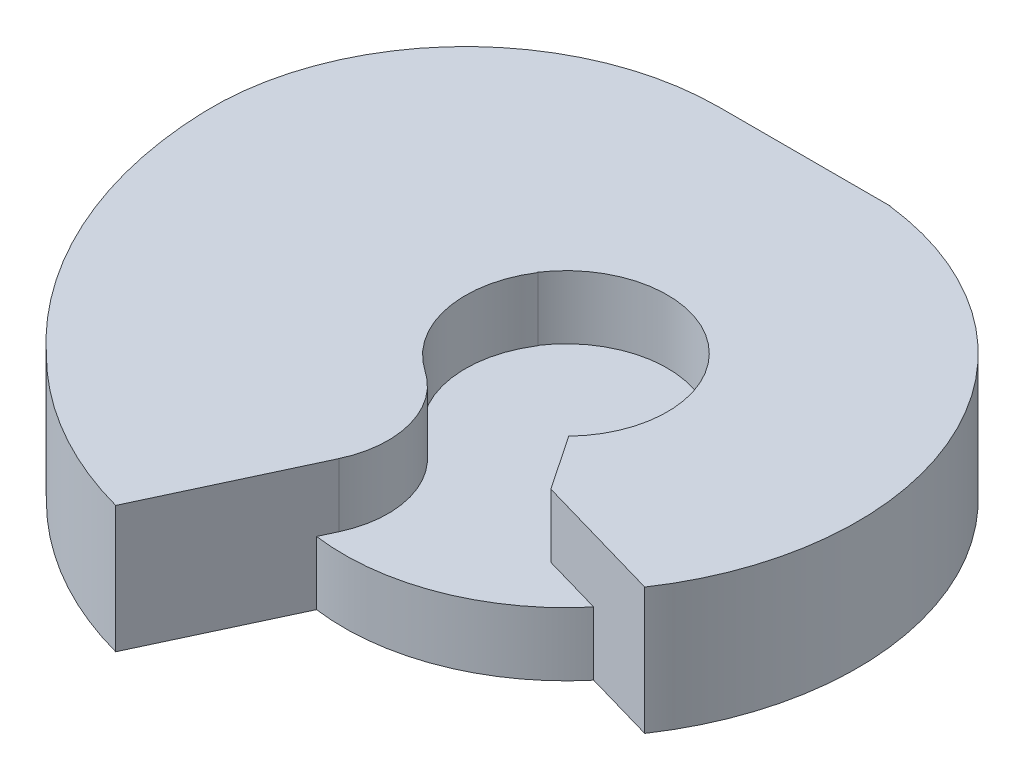
ISO-10303-21;
HEADER;
FILE_DESCRIPTION(('STEP AP214'),'2;1');
FILE_NAME('part.step','',(''),(''),'','','');
FILE_SCHEMA(('AUTOMOTIVE_DESIGN { 1 0 10303 214 1 1 1 1 }'));
ENDSEC;
DATA;
#1=APPLICATION_CONTEXT('core data for automotive mechanical design processes');
#2=APPLICATION_PROTOCOL_DEFINITION('international standard','automotive_design',2000,#1);
#3=PRODUCT_CONTEXT('',#1,'mechanical');
#4=PRODUCT('Part','Part','',(#3));
#5=PRODUCT_RELATED_PRODUCT_CATEGORY('part','',(#4));
#6=PRODUCT_DEFINITION_FORMATION('','',#4);
#7=PRODUCT_DEFINITION_CONTEXT('part definition',#1,'design');
#8=PRODUCT_DEFINITION('design','',#6,#7);
#9=PRODUCT_DEFINITION_SHAPE('','',#8);
#10=(LENGTH_UNIT() NAMED_UNIT(*) SI_UNIT(.MILLI.,.METRE.));
#11=(NAMED_UNIT(*) PLANE_ANGLE_UNIT() SI_UNIT($,.RADIAN.));
#12=(NAMED_UNIT(*) SI_UNIT($,.STERADIAN.) SOLID_ANGLE_UNIT());
#13=UNCERTAINTY_MEASURE_WITH_UNIT(LENGTH_MEASURE(1.E-05),#10,'distance_accuracy_value','');
#14=(GEOMETRIC_REPRESENTATION_CONTEXT(3) GLOBAL_UNCERTAINTY_ASSIGNED_CONTEXT((#13)) GLOBAL_UNIT_ASSIGNED_CONTEXT((#10,
#11,#12)) REPRESENTATION_CONTEXT('',''));
#15=CARTESIAN_POINT('',(0.,0.,0.));
#16=DIRECTION('',(0.,0.,1.));
#17=DIRECTION('',(1.,0.,0.));
#18=AXIS2_PLACEMENT_3D('',#15,#16,#17);
#19=CARTESIAN_POINT('',(0.,2.54,0.));
#20=DIRECTION('',(0.,-1.,0.));
#21=DIRECTION('',(0.,0.,-1.));
#22=AXIS2_PLACEMENT_3D('',#19,#20,#21);
#23=CYLINDRICAL_SURFACE('',#22,8.89);
#24=CARTESIAN_POINT('',(0.,2.54,0.));
#25=DIRECTION('',(0.,1.,0.));
#26=DIRECTION('',(0.,0.,1.));
#27=AXIS2_PLACEMENT_3D('',#24,#25,#26);
#28=CIRCLE('',#27,8.89);
#29=CARTESIAN_POINT('',(-1.18296740067766,2.54,8.81094138721476));
#30=VERTEX_POINT('',#29);
#31=CARTESIAN_POINT('',(6.81863639489275,2.54,5.70423506828427));
#32=VERTEX_POINT('',#31);
#33=EDGE_CURVE('E11',#30,#32,#28,.T.);
#34=ORIENTED_EDGE('',*,*,#33,.F.);
#35=DIRECTION('',(0.,-1.,0.));
#36=VECTOR('',#35,1.);
#37=CARTESIAN_POINT('',(-1.18296740067766,2.54,8.81094138721476));
#38=LINE('',#37,#36);
#39=CARTESIAN_POINT('',(-1.18296740067766,0.,8.81094138721476));
#40=VERTEX_POINT('',#39);
#41=EDGE_CURVE('E261',#30,#40,#38,.T.);
#42=ORIENTED_EDGE('',*,*,#41,.T.);
#43=CARTESIAN_POINT('',(0.,0.,0.));
#44=DIRECTION('',(0.,1.,0.));
#45=DIRECTION('',(0.,0.,1.));
#46=AXIS2_PLACEMENT_3D('',#43,#44,#45);
#47=CIRCLE('',#46,8.89);
#48=CARTESIAN_POINT('',(6.81863639489275,0.,5.70423506828427));
#49=VERTEX_POINT('',#48);
#50=EDGE_CURVE('E36',#40,#49,#47,.T.);
#51=ORIENTED_EDGE('',*,*,#50,.T.);
#52=DIRECTION('',(0.,-1.,0.));
#53=VECTOR('',#52,1.);
#54=CARTESIAN_POINT('',(6.81863639489275,2.54,5.70423506828426));
#55=LINE('',#54,#53);
#56=EDGE_CURVE('E245',#49,#32,#55,.F.);
#57=ORIENTED_EDGE('',*,*,#56,.T.);
#58=EDGE_LOOP('',(#34,#42,#51,#57));
#59=FACE_BOUND('',#58,.T.);
#60=ADVANCED_FACE('F33',(#59),#23,.T.);
#61=CARTESIAN_POINT('',(0.,2.54,0.));
#62=DIRECTION('',(0.,1.,0.));
#63=DIRECTION('',(0.,0.,1.));
#64=AXIS2_PLACEMENT_3D('',#61,#62,#63);
#65=PLANE('',#64);
#66=DIRECTION('',(0.422999439972229,0.,-0.906129943100426));
#67=VECTOR('',#66,1.);
#68=CARTESIAN_POINT('',(2.40586659866002,2.54,1.12310627369732));
#69=LINE('',#68,#67);
#70=CARTESIAN_POINT('',(-0.896741690193564,2.54,8.19780183607998));
#71=VERTEX_POINT('',#70);
#72=EDGE_CURVE('E259',#30,#71,#69,.T.);
#73=ORIENTED_EDGE('',*,*,#72,.F.);
#74=ORIENTED_EDGE('',*,*,#33,.T.);
#75=DIRECTION('',(0.961101160237647,0.,0.276196596267674));
#76=VECTOR('',#75,1.);
#77=CARTESIAN_POINT('',(-0.994048889296909,2.54,3.45906341260739));
#78=LINE('',#77,#76);
#79=CARTESIAN_POINT('',(4.40931347536969,2.54,5.01185551739763));
#80=VERTEX_POINT('',#79);
#81=EDGE_CURVE('E215',#80,#32,#78,.T.);
#82=ORIENTED_EDGE('',*,*,#81,.F.);
#83=DIRECTION('',(0.558710453156858,0.,0.829362785235303));
#84=VECTOR('',#83,1.);
#85=CARTESIAN_POINT('',(0.710551953024544,2.54,-0.478672072985769));
#86=LINE('',#85,#84);
#87=CARTESIAN_POINT('',(2.93012266473458,2.54,2.81611029074016));
#88=VERTEX_POINT('',#87);
#89=EDGE_CURVE('E248',#88,#80,#86,.T.);
#90=ORIENTED_EDGE('',*,*,#89,.F.);
#91=CARTESIAN_POINT('',(0.,2.54,-1.38777878078145E-13));
#92=DIRECTION('',(0.,1.,0.));
#93=DIRECTION('',(0.,0.,1.));
#94=AXIS2_PLACEMENT_3D('',#91,#92,#93);
#95=CIRCLE('',#94,4.06399999999996);
#96=CARTESIAN_POINT('',(-3.38865125383862,2.54,-2.24346577416695));
#97=VERTEX_POINT('',#96);
#98=EDGE_CURVE('E251',#97,#88,#95,.F.);
#99=ORIENTED_EDGE('',*,*,#98,.F.);
#100=DIRECTION('',(-0.996231269840825,0.,0.0867367107477386));
#101=VECTOR('',#100,1.);
#102=CARTESIAN_POINT('',(-0.219351175788312,2.54,-2.51940036130971));
#103=LINE('',#102,#101);
#104=CARTESIAN_POINT('',(-3.36686769916218,2.54,-2.24536235575179));
#105=VERTEX_POINT('',#104);
#106=EDGE_CURVE('E254',#105,#97,#103,.T.);
#107=ORIENTED_EDGE('',*,*,#106,.F.);
#108=CARTESIAN_POINT('',(0.12699998876601,2.54,5.34193615314704E-05));
#109=DIRECTION('',(0.,1.,0.));
#110=DIRECTION('',(0.,0.,1.));
#111=AXIS2_PLACEMENT_3D('',#108,#109,#110);
#112=CIRCLE('',#111,4.15319195605939);
#113=CARTESIAN_POINT('',(-2.20750220203594,2.54,3.43503565294257));
#114=VERTEX_POINT('',#113);
#115=EDGE_CURVE('E52',#114,#105,#112,.F.);
#116=ORIENTED_EDGE('',*,*,#115,.F.);
#117=CARTESIAN_POINT('',(-4.3490967734062,2.54,6.58617396978578));
#118=DIRECTION('',(0.,1.,0.));
#119=DIRECTION('',(0.,0.,1.));
#120=AXIS2_PLACEMENT_3D('',#117,#118,#119);
#121=CIRCLE('',#120,3.81000000000001);
#122=EDGE_CURVE('E47',#71,#114,#121,.T.);
#123=ORIENTED_EDGE('',*,*,#122,.F.);
#124=EDGE_LOOP('',(#73,#74,#82,#90,#99,#107,#116,#123));
#125=FACE_BOUND('',#124,.T.);
#126=ADVANCED_FACE('F285',(#125),#65,.T.);
#127=CARTESIAN_POINT('',(0.,0.,0.));
#128=DIRECTION('',(0.,1.,0.));
#129=DIRECTION('',(0.,0.,1.));
#130=AXIS2_PLACEMENT_3D('',#127,#128,#129);
#131=PLANE('',#130);
#132=ORIENTED_EDGE('',*,*,#50,.F.);
#133=DIRECTION('',(-0.422999439972229,0.,0.906129943100425));
#134=VECTOR('',#133,1.);
#135=CARTESIAN_POINT('',(-0.896741690193558,0.,8.19780183607998));
#136=LINE('',#135,#134);
#137=CARTESIAN_POINT('',(-3.74356275405042,0.,14.2961309704615));
#138=VERTEX_POINT('',#137);
#139=EDGE_CURVE('E163',#40,#138,#136,.T.);
#140=ORIENTED_EDGE('',*,*,#139,.T.);
#141=CARTESIAN_POINT('',(0.12699998876601,0.,5.34193615314704E-05));
#142=DIRECTION('',(0.,-1.,0.));
#143=DIRECTION('',(0.,0.,-1.));
#144=AXIS2_PLACEMENT_3D('',#141,#142,#143);
#145=CIRCLE('',#144,14.810776120553);
#146=CARTESIAN_POINT('',(-10.3107467521251,0.,10.5077902007127));
#147=VERTEX_POINT('',#146);
#148=EDGE_CURVE('E197',#138,#147,#145,.T.);
#149=ORIENTED_EDGE('',*,*,#148,.T.);
#150=CARTESIAN_POINT('',(0.92360074772051,0.,-1.66043873636552));
#151=DIRECTION('',(0.,-1.,0.));
#152=DIRECTION('',(0.,0.,-1.));
#153=AXIS2_PLACEMENT_3D('',#150,#151,#152);
#154=CIRCLE('',#153,16.5612909887012);
#155=CARTESIAN_POINT('',(-15.6292565634232,0.,-1.13197487823374));
#156=VERTEX_POINT('',#155);
#157=EDGE_CURVE('E141',#147,#156,#154,.T.);
#158=ORIENTED_EDGE('',*,*,#157,.T.);
#159=CARTESIAN_POINT('',(-5.4744304453411,0.,-1.4561762223368));
#160=DIRECTION('',(0.,-1.,0.));
#161=DIRECTION('',(0.,0.,-1.));
#162=AXIS2_PLACEMENT_3D('',#159,#160,#161);
#163=CIRCLE('',#162,10.16);
#164=CARTESIAN_POINT('',(-5.4701568964112,0.,-11.6161753235562));
#165=VERTEX_POINT('',#164);
#166=EDGE_CURVE('E200',#156,#165,#163,.T.);
#167=ORIENTED_EDGE('',*,*,#166,.T.);
#168=DIRECTION('',(0.999999911537345,0.,0.000420624894676838));
#169=VECTOR('',#168,1.);
#170=CARTESIAN_POINT('',(-5.47015689641119,0.,-11.6161753235562));
#171=LINE('',#170,#169);
#172=CARTESIAN_POINT('',(1.37050672928064,0.,-11.6132979698846));
#173=VERTEX_POINT('',#172);
#174=EDGE_CURVE('E203',#165,#173,#171,.T.);
#175=ORIENTED_EDGE('',*,*,#174,.T.);
#176=DIRECTION('',(-0.00042062489484359,0.,0.999999911537345));
#177=VECTOR('',#176,1.);
#178=CARTESIAN_POINT('',(1.37050672928064,0.,-11.6132979698846));
#179=LINE('',#178,#177);
#180=CARTESIAN_POINT('',(1.37050254215348,0.,-11.603343431182));
#181=VERTEX_POINT('',#180);
#182=EDGE_CURVE('E206',#173,#181,#179,.T.);
#183=ORIENTED_EDGE('',*,*,#182,.T.);
#184=CARTESIAN_POINT('',(0.,0.,-1.38777878078145E-13));
#185=DIRECTION('',(0.,-1.,0.));
#186=DIRECTION('',(0.,0.,-1.));
#187=AXIS2_PLACEMENT_3D('',#184,#185,#186);
#188=CIRCLE('',#187,11.6840000000004);
#189=CARTESIAN_POINT('',(9.6894282753847,0.,6.5292293340165));
#190=VERTEX_POINT('',#189);
#191=EDGE_CURVE('E209',#181,#190,#188,.T.);
#192=ORIENTED_EDGE('',*,*,#191,.T.);
#193=DIRECTION('',(-0.961101160237647,0.,-0.276196596267674));
#194=VECTOR('',#193,1.);
#195=CARTESIAN_POINT('',(9.68942827538496,0.,6.52922933401667));
#196=LINE('',#195,#194);
#197=EDGE_CURVE('E165',#190,#49,#196,.T.);
#198=ORIENTED_EDGE('',*,*,#197,.T.);
#199=EDGE_LOOP('',(#132,#140,#149,#158,#167,#175,#183,#192,#198));
#200=FACE_BOUND('',#199,.T.);
#201=ADVANCED_FACE('F272',(#200),#131,.F.);
#202=CARTESIAN_POINT('',(-0.896741690193558,5.08,8.19780183607998));
#203=DIRECTION('',(0.906129943100425,0.,0.422999439972229));
#204=DIRECTION('',(0.422999439972229,0.,-0.906129943100426));
#205=AXIS2_PLACEMENT_3D('',#202,#203,#204);
#206=PLANE('',#205);
#207=ORIENTED_EDGE('',*,*,#41,.F.);
#208=ORIENTED_EDGE('',*,*,#72,.T.);
#209=DIRECTION('',(0.,-1.,0.));
#210=VECTOR('',#209,1.);
#211=CARTESIAN_POINT('',(-0.896741690193564,5.08,8.19780183607998));
#212=LINE('',#211,#210);
#213=CARTESIAN_POINT('',(-0.896741690193564,5.08,8.19780183607998));
#214=VERTEX_POINT('',#213);
#215=EDGE_CURVE('E216',#214,#71,#212,.T.);
#216=ORIENTED_EDGE('',*,*,#215,.F.);
#217=DIRECTION('',(-0.422999439972229,0.,0.906129943100425));
#218=VECTOR('',#217,1.);
#219=CARTESIAN_POINT('',(-0.896741690193558,5.08,8.19780183607998));
#220=LINE('',#219,#218);
#221=CARTESIAN_POINT('',(-3.74356275405042,5.08,14.2961309704615));
#222=VERTEX_POINT('',#221);
#223=EDGE_CURVE('E147',#214,#222,#220,.T.);
#224=ORIENTED_EDGE('',*,*,#223,.T.);
#225=DIRECTION('',(0.,-1.,0.));
#226=VECTOR('',#225,1.);
#227=CARTESIAN_POINT('',(-3.74356275405042,5.08,14.2961309704615));
#228=LINE('',#227,#226);
#229=EDGE_CURVE('E162',#222,#138,#228,.T.);
#230=ORIENTED_EDGE('',*,*,#229,.T.);
#231=ORIENTED_EDGE('',*,*,#139,.F.);
#232=EDGE_LOOP('',(#207,#208,#216,#224,#230,#231));
#233=FACE_BOUND('',#232,.T.);
#234=ADVANCED_FACE('F297',(#233),#206,.T.);
#235=CARTESIAN_POINT('',(9.68942827538496,5.08,6.52922933401667));
#236=DIRECTION('',(-0.276196596267674,0.,0.961101160237647));
#237=DIRECTION('',(0.961101160237647,0.,0.276196596267674));
#238=AXIS2_PLACEMENT_3D('',#235,#236,#237);
#239=PLANE('',#238);
#240=ORIENTED_EDGE('',*,*,#56,.F.);
#241=ORIENTED_EDGE('',*,*,#197,.F.);
#242=DIRECTION('',(0.,-1.,0.));
#243=VECTOR('',#242,1.);
#244=CARTESIAN_POINT('',(9.6894282753847,5.08,6.5292293340165));
#245=LINE('',#244,#243);
#246=CARTESIAN_POINT('',(9.6894282753847,5.08,6.5292293340165));
#247=VERTEX_POINT('',#246);
#248=EDGE_CURVE('E234',#247,#190,#245,.T.);
#249=ORIENTED_EDGE('',*,*,#248,.F.);
#250=DIRECTION('',(-0.961101160237647,0.,-0.276196596267674));
#251=VECTOR('',#250,1.);
#252=CARTESIAN_POINT('',(9.68942827538496,5.08,6.52922933401667));
#253=LINE('',#252,#251);
#254=CARTESIAN_POINT('',(4.40931347536969,5.08,5.01185551739763));
#255=VERTEX_POINT('',#254);
#256=EDGE_CURVE('E178',#247,#255,#253,.T.);
#257=ORIENTED_EDGE('',*,*,#256,.T.);
#258=DIRECTION('',(0.,-1.,0.));
#259=VECTOR('',#258,1.);
#260=CARTESIAN_POINT('',(4.40931347536969,5.08,5.01185551739763));
#261=LINE('',#260,#259);
#262=EDGE_CURVE('E231',#255,#80,#261,.T.);
#263=ORIENTED_EDGE('',*,*,#262,.T.);
#264=ORIENTED_EDGE('',*,*,#81,.T.);
#265=EDGE_LOOP('',(#240,#241,#249,#257,#263,#264));
#266=FACE_BOUND('',#265,.T.);
#267=ADVANCED_FACE('F271',(#266),#239,.T.);
#268=CARTESIAN_POINT('',(0.12699998876601,5.08,5.34193615314704E-05));
#269=DIRECTION('',(0.,-1.,0.));
#270=DIRECTION('',(0.,0.,-1.));
#271=AXIS2_PLACEMENT_3D('',#268,#269,#270);
#272=CYLINDRICAL_SURFACE('',#271,14.810776120553);
#273=ORIENTED_EDGE('',*,*,#148,.F.);
#274=ORIENTED_EDGE('',*,*,#229,.F.);
#275=CARTESIAN_POINT('',(0.12699998876601,5.08,5.34193615314704E-05));
#276=DIRECTION('',(0.,-1.,0.));
#277=DIRECTION('',(0.,0.,-1.));
#278=AXIS2_PLACEMENT_3D('',#275,#276,#277);
#279=CIRCLE('',#278,14.810776120553);
#280=CARTESIAN_POINT('',(-10.3107467521251,5.08,10.5077902007127));
#281=VERTEX_POINT('',#280);
#282=EDGE_CURVE('E154',#222,#281,#279,.T.);
#283=ORIENTED_EDGE('',*,*,#282,.T.);
#284=DIRECTION('',(0.,-1.,0.));
#285=VECTOR('',#284,1.);
#286=CARTESIAN_POINT('',(-10.3107467521251,5.08,10.5077902007127));
#287=LINE('',#286,#285);
#288=EDGE_CURVE('E136',#281,#147,#287,.T.);
#289=ORIENTED_EDGE('',*,*,#288,.T.);
#290=EDGE_LOOP('',(#273,#274,#283,#289));
#291=FACE_BOUND('',#290,.T.);
#292=ADVANCED_FACE('F160',(#291),#272,.T.);
#293=CARTESIAN_POINT('',(-4.3490967734062,5.08,6.58617396978578));
#294=DIRECTION('',(0.,-1.,0.));
#295=DIRECTION('',(0.,0.,-1.));
#296=AXIS2_PLACEMENT_3D('',#293,#294,#295);
#297=CYLINDRICAL_SURFACE('',#296,3.81000000000001);
#298=ORIENTED_EDGE('',*,*,#215,.T.);
#299=ORIENTED_EDGE('',*,*,#122,.T.);
#300=DIRECTION('',(0.,-1.,0.));
#301=VECTOR('',#300,1.);
#302=CARTESIAN_POINT('',(-2.20750220203594,5.08,3.43503565294257));
#303=LINE('',#302,#301);
#304=CARTESIAN_POINT('',(-2.20750220203594,5.08,3.43503565294257));
#305=VERTEX_POINT('',#304);
#306=EDGE_CURVE('E219',#305,#114,#303,.T.);
#307=ORIENTED_EDGE('',*,*,#306,.F.);
#308=CARTESIAN_POINT('',(-4.3490967734062,5.08,6.58617396978578));
#309=DIRECTION('',(0.,-1.,0.));
#310=DIRECTION('',(0.,0.,-1.));
#311=AXIS2_PLACEMENT_3D('',#308,#309,#310);
#312=CIRCLE('',#311,3.81000000000001);
#313=EDGE_CURVE('E193',#305,#214,#312,.T.);
#314=ORIENTED_EDGE('',*,*,#313,.T.);
#315=EDGE_LOOP('',(#298,#299,#307,#314));
#316=FACE_BOUND('',#315,.T.);
#317=ADVANCED_FACE('F295',(#316),#297,.T.);
#318=CARTESIAN_POINT('',(0.12699998876601,5.08,5.34193615314704E-05));
#319=DIRECTION('',(0.,-1.,0.));
#320=DIRECTION('',(0.,0.,-1.));
#321=AXIS2_PLACEMENT_3D('',#318,#319,#320);
#322=CYLINDRICAL_SURFACE('',#321,4.15319195605939);
#323=ORIENTED_EDGE('',*,*,#306,.T.);
#324=ORIENTED_EDGE('',*,*,#115,.T.);
#325=DIRECTION('',(0.,-1.,0.));
#326=VECTOR('',#325,1.);
#327=CARTESIAN_POINT('',(-3.36686769916218,5.08,-2.24536235575179));
#328=LINE('',#327,#326);
#329=CARTESIAN_POINT('',(-3.36686769916218,5.08,-2.24536235575179));
#330=VERTEX_POINT('',#329);
#331=EDGE_CURVE('E222',#330,#105,#328,.T.);
#332=ORIENTED_EDGE('',*,*,#331,.F.);
#333=CARTESIAN_POINT('',(0.12699998876601,5.08,5.34193615314704E-05));
#334=DIRECTION('',(0.,1.,0.));
#335=DIRECTION('',(0.,0.,-1.));
#336=AXIS2_PLACEMENT_3D('',#333,#334,#335);
#337=CIRCLE('',#336,4.15319195605939);
#338=EDGE_CURVE('E190',#330,#305,#337,.T.);
#339=ORIENTED_EDGE('',*,*,#338,.T.);
#340=EDGE_LOOP('',(#323,#324,#332,#339));
#341=FACE_BOUND('',#340,.T.);
#342=ADVANCED_FACE('F293',(#341),#322,.F.);
#343=CARTESIAN_POINT('',(-3.38865125383808,5.08,-2.24346577416659));
#344=DIRECTION('',(-0.0867367107477386,0.,-0.996231269840825));
#345=DIRECTION('',(-0.996231269840825,0.,0.0867367107477386));
#346=AXIS2_PLACEMENT_3D('',#343,#344,#345);
#347=PLANE('',#346);
#348=ORIENTED_EDGE('',*,*,#331,.T.);
#349=ORIENTED_EDGE('',*,*,#106,.T.);
#350=DIRECTION('',(0.,-1.,0.));
#351=VECTOR('',#350,1.);
#352=CARTESIAN_POINT('',(-3.38865125383862,5.08,-2.24346577416695));
#353=LINE('',#352,#351);
#354=CARTESIAN_POINT('',(-3.38865125383862,5.08,-2.24346577416695));
#355=VERTEX_POINT('',#354);
#356=EDGE_CURVE('E225',#355,#97,#353,.T.);
#357=ORIENTED_EDGE('',*,*,#356,.F.);
#358=DIRECTION('',(0.996231269840825,0.,-0.0867367107477386));
#359=VECTOR('',#358,1.);
#360=CARTESIAN_POINT('',(-3.38865125383808,5.08,-2.24346577416659));
#361=LINE('',#360,#359);
#362=EDGE_CURVE('E187',#355,#330,#361,.T.);
#363=ORIENTED_EDGE('',*,*,#362,.T.);
#364=EDGE_LOOP('',(#348,#349,#357,#363));
#365=FACE_BOUND('',#364,.T.);
#366=ADVANCED_FACE('F289',(#365),#347,.T.);
#367=CARTESIAN_POINT('',(0.,5.08,-1.38777878078145E-13));
#368=DIRECTION('',(0.,-1.,0.));
#369=DIRECTION('',(0.,0.,-1.));
#370=AXIS2_PLACEMENT_3D('',#367,#368,#369);
#371=CYLINDRICAL_SURFACE('',#370,4.06399999999996);
#372=ORIENTED_EDGE('',*,*,#356,.T.);
#373=ORIENTED_EDGE('',*,*,#98,.T.);
#374=DIRECTION('',(0.,-1.,0.));
#375=VECTOR('',#374,1.);
#376=CARTESIAN_POINT('',(2.93012266473458,5.08,2.81611029074016));
#377=LINE('',#376,#375);
#378=CARTESIAN_POINT('',(2.93012266473458,5.08,2.81611029074016));
#379=VERTEX_POINT('',#378);
#380=EDGE_CURVE('E228',#379,#88,#377,.T.);
#381=ORIENTED_EDGE('',*,*,#380,.F.);
#382=CARTESIAN_POINT('',(0.,5.08,-1.38777878078145E-13));
#383=DIRECTION('',(0.,1.,0.));
#384=DIRECTION('',(0.,0.,-1.));
#385=AXIS2_PLACEMENT_3D('',#382,#383,#384);
#386=CIRCLE('',#385,4.06399999999996);
#387=EDGE_CURVE('E184',#379,#355,#386,.T.);
#388=ORIENTED_EDGE('',*,*,#387,.T.);
#389=EDGE_LOOP('',(#372,#373,#381,#388));
#390=FACE_BOUND('',#389,.T.);
#391=ADVANCED_FACE('F287',(#390),#371,.F.);
#392=CARTESIAN_POINT('',(4.40931347536969,5.08,5.01185551739763));
#393=DIRECTION('',(-0.829362785235303,0.,0.558710453156858));
#394=DIRECTION('',(0.558710453156858,0.,0.829362785235303));
#395=AXIS2_PLACEMENT_3D('',#392,#393,#394);
#396=PLANE('',#395);
#397=ORIENTED_EDGE('',*,*,#380,.T.);
#398=ORIENTED_EDGE('',*,*,#89,.T.);
#399=ORIENTED_EDGE('',*,*,#262,.F.);
#400=DIRECTION('',(-0.558710453156858,0.,-0.829362785235303));
#401=VECTOR('',#400,1.);
#402=CARTESIAN_POINT('',(4.40931347536969,5.08,5.01185551739763));
#403=LINE('',#402,#401);
#404=EDGE_CURVE('E181',#255,#379,#403,.T.);
#405=ORIENTED_EDGE('',*,*,#404,.T.);
#406=EDGE_LOOP('',(#397,#398,#399,#405));
#407=FACE_BOUND('',#406,.T.);
#408=ADVANCED_FACE('F284',(#407),#396,.T.);
#409=CARTESIAN_POINT('',(0.,5.08,-1.38777878078145E-13));
#410=DIRECTION('',(0.,-1.,0.));
#411=DIRECTION('',(0.,0.,-1.));
#412=AXIS2_PLACEMENT_3D('',#409,#410,#411);
#413=CYLINDRICAL_SURFACE('',#412,11.6840000000004);
#414=ORIENTED_EDGE('',*,*,#191,.F.);
#415=DIRECTION('',(0.,-1.,0.));
#416=VECTOR('',#415,1.);
#417=CARTESIAN_POINT('',(1.37050254215348,5.08,-11.603343431182));
#418=LINE('',#417,#416);
#419=CARTESIAN_POINT('',(1.37050254215348,5.08,-11.603343431182));
#420=VERTEX_POINT('',#419);
#421=EDGE_CURVE('E236',#420,#181,#418,.T.);
#422=ORIENTED_EDGE('',*,*,#421,.F.);
#423=CARTESIAN_POINT('',(0.,5.08,-1.38777878078145E-13));
#424=DIRECTION('',(0.,-1.,0.));
#425=DIRECTION('',(0.,0.,-1.));
#426=AXIS2_PLACEMENT_3D('',#423,#424,#425);
#427=CIRCLE('',#426,11.6840000000004);
#428=EDGE_CURVE('E175',#420,#247,#427,.T.);
#429=ORIENTED_EDGE('',*,*,#428,.T.);
#430=ORIENTED_EDGE('',*,*,#248,.T.);
#431=EDGE_LOOP('',(#414,#422,#429,#430));
#432=FACE_BOUND('',#431,.T.);
#433=ADVANCED_FACE('F276',(#432),#413,.T.);
#434=CARTESIAN_POINT('',(1.37050672928064,5.08,-11.6132979698846));
#435=DIRECTION('',(0.999999911537345,0.,0.00042062489484359));
#436=DIRECTION('',(0.00042062489484359,0.,-0.999999911537345));
#437=AXIS2_PLACEMENT_3D('',#434,#435,#436);
#438=PLANE('',#437);
#439=ORIENTED_EDGE('',*,*,#182,.F.);
#440=DIRECTION('',(0.,-1.,0.));
#441=VECTOR('',#440,1.);
#442=CARTESIAN_POINT('',(1.37050672928064,5.08,-11.6132979698846));
#443=LINE('',#442,#441);
#444=CARTESIAN_POINT('',(1.37050672928064,5.08,-11.6132979698846));
#445=VERTEX_POINT('',#444);
#446=EDGE_CURVE('E238',#445,#173,#443,.T.);
#447=ORIENTED_EDGE('',*,*,#446,.F.);
#448=DIRECTION('',(-0.00042062489484359,0.,0.999999911537345));
#449=VECTOR('',#448,1.);
#450=CARTESIAN_POINT('',(1.37050672928064,5.08,-11.6132979698846));
#451=LINE('',#450,#449);
#452=EDGE_CURVE('E172',#445,#420,#451,.T.);
#453=ORIENTED_EDGE('',*,*,#452,.T.);
#454=ORIENTED_EDGE('',*,*,#421,.T.);
#455=EDGE_LOOP('',(#439,#447,#453,#454));
#456=FACE_BOUND('',#455,.T.);
#457=ADVANCED_FACE('F305',(#456),#438,.T.);
#458=CARTESIAN_POINT('',(-5.47015689641119,5.08,-11.6161753235562));
#459=DIRECTION('',(0.000420624894676838,0.,-0.999999911537345));
#460=DIRECTION('',(-0.999999911537345,0.,-0.000420624894676838));
#461=AXIS2_PLACEMENT_3D('',#458,#459,#460);
#462=PLANE('',#461);
#463=ORIENTED_EDGE('',*,*,#174,.F.);
#464=DIRECTION('',(0.,-1.,0.));
#465=VECTOR('',#464,1.);
#466=CARTESIAN_POINT('',(-5.4701568964112,5.08,-11.6161753235562));
#467=LINE('',#466,#465);
#468=CARTESIAN_POINT('',(-5.4701568964112,5.08,-11.6161753235562));
#469=VERTEX_POINT('',#468);
#470=EDGE_CURVE('E240',#469,#165,#467,.T.);
#471=ORIENTED_EDGE('',*,*,#470,.F.);
#472=DIRECTION('',(0.999999911537345,0.,0.000420624894676838));
#473=VECTOR('',#472,1.);
#474=CARTESIAN_POINT('',(-5.47015689641119,5.08,-11.6161753235562));
#475=LINE('',#474,#473);
#476=EDGE_CURVE('E169',#469,#445,#475,.T.);
#477=ORIENTED_EDGE('',*,*,#476,.T.);
#478=ORIENTED_EDGE('',*,*,#446,.T.);
#479=EDGE_LOOP('',(#463,#471,#477,#478));
#480=FACE_BOUND('',#479,.T.);
#481=ADVANCED_FACE('F303',(#480),#462,.T.);
#482=CARTESIAN_POINT('',(-5.4744304453411,5.08,-1.4561762223368));
#483=DIRECTION('',(0.,-1.,0.));
#484=DIRECTION('',(0.,0.,-1.));
#485=AXIS2_PLACEMENT_3D('',#482,#483,#484);
#486=CYLINDRICAL_SURFACE('',#485,10.16);
#487=ORIENTED_EDGE('',*,*,#166,.F.);
#488=DIRECTION('',(0.,-1.,0.));
#489=VECTOR('',#488,1.);
#490=CARTESIAN_POINT('',(-15.6292565634232,5.08,-1.13197487823374));
#491=LINE('',#490,#489);
#492=CARTESIAN_POINT('',(-15.6292565634232,5.08,-1.13197487823374));
#493=VERTEX_POINT('',#492);
#494=EDGE_CURVE('E146',#493,#156,#491,.T.);
#495=ORIENTED_EDGE('',*,*,#494,.F.);
#496=CARTESIAN_POINT('',(-5.4744304453411,5.08,-1.4561762223368));
#497=DIRECTION('',(0.,-1.,0.));
#498=DIRECTION('',(0.,0.,-1.));
#499=AXIS2_PLACEMENT_3D('',#496,#497,#498);
#500=CIRCLE('',#499,10.16);
#501=EDGE_CURVE('E158',#493,#469,#500,.T.);
#502=ORIENTED_EDGE('',*,*,#501,.T.);
#503=ORIENTED_EDGE('',*,*,#470,.T.);
#504=EDGE_LOOP('',(#487,#495,#502,#503));
#505=FACE_BOUND('',#504,.T.);
#506=ADVANCED_FACE('F301',(#505),#486,.T.);
#507=CARTESIAN_POINT('',(0.92360074772051,5.08,-1.66043873636552));
#508=DIRECTION('',(0.,-1.,0.));
#509=DIRECTION('',(0.,0.,-1.));
#510=AXIS2_PLACEMENT_3D('',#507,#508,#509);
#511=CYLINDRICAL_SURFACE('',#510,16.5612909887012);
#512=ORIENTED_EDGE('',*,*,#157,.F.);
#513=ORIENTED_EDGE('',*,*,#288,.F.);
#514=CARTESIAN_POINT('',(0.92360074772051,5.08,-1.66043873636552));
#515=DIRECTION('',(0.,-1.,0.));
#516=DIRECTION('',(0.,0.,-1.));
#517=AXIS2_PLACEMENT_3D('',#514,#515,#516);
#518=CIRCLE('',#517,16.5612909887012);
#519=EDGE_CURVE('E139',#281,#493,#518,.T.);
#520=ORIENTED_EDGE('',*,*,#519,.T.);
#521=ORIENTED_EDGE('',*,*,#494,.T.);
#522=EDGE_LOOP('',(#512,#513,#520,#521));
#523=FACE_BOUND('',#522,.T.);
#524=ADVANCED_FACE('F138',(#523),#511,.T.);
#525=CARTESIAN_POINT('',(0.12699998876601,5.08,5.34193615314704E-05));
#526=DIRECTION('',(0.,-1.,0.));
#527=DIRECTION('',(0.,0.,-1.));
#528=AXIS2_PLACEMENT_3D('',#525,#526,#527);
#529=PLANE('',#528);
#530=ORIENTED_EDGE('',*,*,#282,.F.);
#531=ORIENTED_EDGE('',*,*,#223,.F.);
#532=ORIENTED_EDGE('',*,*,#313,.F.);
#533=ORIENTED_EDGE('',*,*,#338,.F.);
#534=ORIENTED_EDGE('',*,*,#362,.F.);
#535=ORIENTED_EDGE('',*,*,#387,.F.);
#536=ORIENTED_EDGE('',*,*,#404,.F.);
#537=ORIENTED_EDGE('',*,*,#256,.F.);
#538=ORIENTED_EDGE('',*,*,#428,.F.);
#539=ORIENTED_EDGE('',*,*,#452,.F.);
#540=ORIENTED_EDGE('',*,*,#476,.F.);
#541=ORIENTED_EDGE('',*,*,#501,.F.);
#542=ORIENTED_EDGE('',*,*,#519,.F.);
#543=EDGE_LOOP('',(#530,#531,#532,#533,#534,#535,#536,#537,#538,#539,#540,#541,#542));
#544=FACE_BOUND('',#543,.T.);
#545=ADVANCED_FACE('F152',(#544),#529,.F.);
#546=CLOSED_SHELL('',(#60,#126,#201,#234,#267,#292,#317,#342,#366,#391,#408,#433,#457,#481,#506,
#524,#545));
#547=MANIFOLD_SOLID_BREP('B2',#546);
#548=ADVANCED_BREP_SHAPE_REPRESENTATION('',(#18,#547),#14);
#549=SHAPE_DEFINITION_REPRESENTATION(#9,#548);
ENDSEC;
END-ISO-10303-21;
